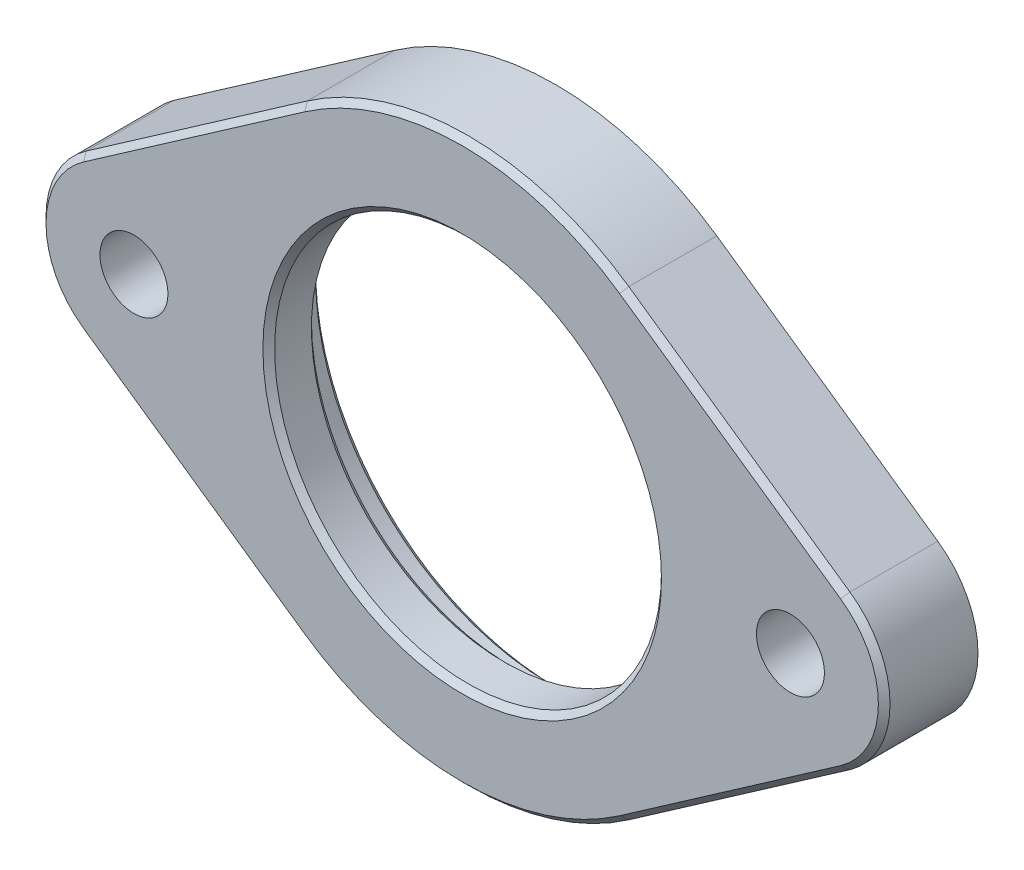
ISO-10303-21;
HEADER;
FILE_DESCRIPTION(('STEP AP214'),'2;1');
FILE_NAME('part.step','',(''),(''),'','','');
FILE_SCHEMA(('AUTOMOTIVE_DESIGN { 1 0 10303 214 1 1 1 1 }'));
ENDSEC;
DATA;
#1=APPLICATION_CONTEXT('core data for automotive mechanical design processes');
#2=APPLICATION_PROTOCOL_DEFINITION('international standard','automotive_design',2000,#1);
#3=PRODUCT_CONTEXT('',#1,'mechanical');
#4=PRODUCT('Part','Part','',(#3));
#5=PRODUCT_RELATED_PRODUCT_CATEGORY('part','',(#4));
#6=PRODUCT_DEFINITION_FORMATION('','',#4);
#7=PRODUCT_DEFINITION_CONTEXT('part definition',#1,'design');
#8=PRODUCT_DEFINITION('design','',#6,#7);
#9=PRODUCT_DEFINITION_SHAPE('','',#8);
#10=(LENGTH_UNIT() NAMED_UNIT(*) SI_UNIT(.MILLI.,.METRE.));
#11=(NAMED_UNIT(*) PLANE_ANGLE_UNIT() SI_UNIT($,.RADIAN.));
#12=(NAMED_UNIT(*) SI_UNIT($,.STERADIAN.) SOLID_ANGLE_UNIT());
#13=UNCERTAINTY_MEASURE_WITH_UNIT(LENGTH_MEASURE(1.E-05),#10,'distance_accuracy_value','');
#14=(GEOMETRIC_REPRESENTATION_CONTEXT(3) GLOBAL_UNCERTAINTY_ASSIGNED_CONTEXT((#13)) GLOBAL_UNIT_ASSIGNED_CONTEXT((#10,
#11,#12)) REPRESENTATION_CONTEXT('',''));
#15=CARTESIAN_POINT('',(0.,0.,0.));
#16=DIRECTION('',(0.,0.,1.));
#17=DIRECTION('',(1.,0.,0.));
#18=AXIS2_PLACEMENT_3D('',#15,#16,#17);
#19=CARTESIAN_POINT('',(-14.,0.,4.));
#20=DIRECTION('',(0.,0.,-1.));
#21=DIRECTION('',(-1.,0.,0.));
#22=AXIS2_PLACEMENT_3D('',#19,#20,#21);
#23=CYLINDRICAL_SURFACE('',#22,4.);
#24=DIRECTION('',(0.,0.,-1.));
#25=VECTOR('',#24,1.);
#26=CARTESIAN_POINT('',(-16.2857142857143,-3.28260722659316,4.));
#27=LINE('',#26,#25);
#28=CARTESIAN_POINT('',(-16.2857142857143,-3.28260722659316,3.74999999999999));
#29=VERTEX_POINT('',#28);
#30=CARTESIAN_POINT('',(-16.2857142857143,-3.28260722659316,0.));
#31=VERTEX_POINT('',#30);
#32=EDGE_CURVE('E171',#29,#31,#27,.T.);
#33=ORIENTED_EDGE('',*,*,#32,.F.);
#34=CARTESIAN_POINT('',(-14.,0.,3.74999999999999));
#35=DIRECTION('',(0.,0.,1.));
#36=DIRECTION('',(1.,0.,0.));
#37=AXIS2_PLACEMENT_3D('',#34,#35,#36);
#38=CIRCLE('',#37,4.);
#39=CARTESIAN_POINT('',(-16.2857142857143,3.28260722659316,3.74999999999999));
#40=VERTEX_POINT('',#39);
#41=EDGE_CURVE('E168',#29,#40,#38,.F.);
#42=ORIENTED_EDGE('',*,*,#41,.T.);
#43=DIRECTION('',(0.,0.,-1.));
#44=VECTOR('',#43,1.);
#45=CARTESIAN_POINT('',(-16.2857142857143,3.28260722659316,4.));
#46=LINE('',#45,#44);
#47=CARTESIAN_POINT('',(-16.2857142857143,3.28260722659316,0.));
#48=VERTEX_POINT('',#47);
#49=EDGE_CURVE('E162',#40,#48,#46,.T.);
#50=ORIENTED_EDGE('',*,*,#49,.T.);
#51=CARTESIAN_POINT('',(-14.,0.,0.));
#52=DIRECTION('',(0.,0.,1.));
#53=DIRECTION('',(1.,0.,0.));
#54=AXIS2_PLACEMENT_3D('',#51,#52,#53);
#55=CIRCLE('',#54,4.);
#56=EDGE_CURVE('E165',#48,#31,#55,.T.);
#57=ORIENTED_EDGE('',*,*,#56,.T.);
#58=EDGE_LOOP('',(#33,#42,#50,#57));
#59=FACE_BOUND('',#58,.T.);
#60=ADVANCED_FACE('F73',(#59),#23,.T.);
#61=CARTESIAN_POINT('',(-6.85714285714286,-9.84782167977948,4.));
#62=DIRECTION('',(-0.571428571428572,-0.82065180664829,0.));
#63=DIRECTION('',(0.82065180664829,-0.571428571428572,0.));
#64=AXIS2_PLACEMENT_3D('',#61,#62,#63);
#65=PLANE('',#64);
#66=DIRECTION('',(0.,0.,-1.));
#67=VECTOR('',#66,1.);
#68=CARTESIAN_POINT('',(-6.85714285714286,-9.84782167977948,4.));
#69=LINE('',#68,#67);
#70=CARTESIAN_POINT('',(-6.85714285714286,-9.84782167977948,3.74999999999999));
#71=VERTEX_POINT('',#70);
#72=CARTESIAN_POINT('',(-6.85714285714286,-9.84782167977948,0.));
#73=VERTEX_POINT('',#72);
#74=EDGE_CURVE('E195',#71,#73,#69,.T.);
#75=ORIENTED_EDGE('',*,*,#74,.F.);
#76=DIRECTION('',(-0.82065180664829,0.571428571428572,0.));
#77=VECTOR('',#76,1.);
#78=CARTESIAN_POINT('',(-6.85714285714286,-9.84782167977948,3.74999999999999));
#79=LINE('',#78,#77);
#80=EDGE_CURVE('E260',#71,#29,#79,.T.);
#81=ORIENTED_EDGE('',*,*,#80,.T.);
#82=ORIENTED_EDGE('',*,*,#32,.T.);
#83=DIRECTION('',(-0.82065180664829,0.571428571428572,0.));
#84=VECTOR('',#83,1.);
#85=CARTESIAN_POINT('',(-6.85714285714286,-9.84782167977948,0.));
#86=LINE('',#85,#84);
#87=EDGE_CURVE('E180',#73,#31,#86,.T.);
#88=ORIENTED_EDGE('',*,*,#87,.F.);
#89=EDGE_LOOP('',(#75,#81,#82,#88));
#90=FACE_BOUND('',#89,.T.);
#91=ADVANCED_FACE('F331',(#90),#65,.T.);
#92=CARTESIAN_POINT('',(-6.85714285714286,9.84782167977948,4.));
#93=DIRECTION('',(0.571428571428572,-0.82065180664829,0.));
#94=DIRECTION('',(0.82065180664829,0.571428571428572,0.));
#95=AXIS2_PLACEMENT_3D('',#92,#93,#94);
#96=PLANE('',#95);
#97=ORIENTED_EDGE('',*,*,#49,.F.);
#98=DIRECTION('',(0.82065180664829,0.571428571428572,0.));
#99=VECTOR('',#98,1.);
#100=CARTESIAN_POINT('',(-6.85714285714286,9.84782167977948,3.74999999999999));
#101=LINE('',#100,#99);
#102=CARTESIAN_POINT('',(-6.85714285714286,9.84782167977948,3.74999999999999));
#103=VERTEX_POINT('',#102);
#104=EDGE_CURVE('E83',#40,#103,#101,.T.);
#105=ORIENTED_EDGE('',*,*,#104,.T.);
#106=DIRECTION('',(0.,0.,-1.));
#107=VECTOR('',#106,1.);
#108=CARTESIAN_POINT('',(-6.85714285714286,9.84782167977948,4.));
#109=LINE('',#108,#107);
#110=CARTESIAN_POINT('',(-6.85714285714286,9.84782167977948,0.));
#111=VERTEX_POINT('',#110);
#112=EDGE_CURVE('E183',#103,#111,#109,.T.);
#113=ORIENTED_EDGE('',*,*,#112,.T.);
#114=DIRECTION('',(-0.82065180664829,-0.571428571428572,0.));
#115=VECTOR('',#114,1.);
#116=CARTESIAN_POINT('',(-6.85714285714286,9.84782167977948,0.));
#117=LINE('',#116,#115);
#118=EDGE_CURVE('E177',#111,#48,#117,.T.);
#119=ORIENTED_EDGE('',*,*,#118,.T.);
#120=EDGE_LOOP('',(#97,#105,#113,#119));
#121=FACE_BOUND('',#120,.T.);
#122=ADVANCED_FACE('F182',(#121),#96,.F.);
#123=CARTESIAN_POINT('',(0.,0.,0.));
#124=DIRECTION('',(0.,0.,1.));
#125=DIRECTION('',(1.,0.,0.));
#126=AXIS2_PLACEMENT_3D('',#123,#124,#125);
#127=PLANE('',#126);
#128=CARTESIAN_POINT('',(0.,0.,0.));
#129=DIRECTION('',(0.,0.,1.));
#130=DIRECTION('',(1.,0.,0.));
#131=AXIS2_PLACEMENT_3D('',#128,#129,#130);
#132=CIRCLE('',#131,10.25);
#133=CARTESIAN_POINT('',(10.25,0.,0.));
#134=VERTEX_POINT('',#133);
#135=EDGE_CURVE('E246',#134,#134,#132,.T.);
#136=ORIENTED_EDGE('',*,*,#135,.T.);
#137=EDGE_LOOP('',(#136));
#138=FACE_BOUND('',#137,.T.);
#139=CARTESIAN_POINT('',(-14.,0.,0.));
#140=DIRECTION('',(0.,0.,1.));
#141=DIRECTION('',(1.,0.,0.));
#142=AXIS2_PLACEMENT_3D('',#139,#140,#141);
#143=CIRCLE('',#142,1.45);
#144=CARTESIAN_POINT('',(-12.55,0.,0.));
#145=VERTEX_POINT('',#144);
#146=EDGE_CURVE('E295',#145,#145,#143,.T.);
#147=ORIENTED_EDGE('',*,*,#146,.T.);
#148=EDGE_LOOP('',(#147));
#149=FACE_BOUND('',#148,.T.);
#150=CARTESIAN_POINT('',(14.,0.,0.));
#151=DIRECTION('',(0.,0.,1.));
#152=DIRECTION('',(1.,0.,0.));
#153=AXIS2_PLACEMENT_3D('',#150,#151,#152);
#154=CIRCLE('',#153,1.45);
#155=CARTESIAN_POINT('',(15.45,0.,0.));
#156=VERTEX_POINT('',#155);
#157=EDGE_CURVE('E190',#156,#156,#154,.T.);
#158=ORIENTED_EDGE('',*,*,#157,.T.);
#159=EDGE_LOOP('',(#158));
#160=FACE_BOUND('',#159,.T.);
#161=ORIENTED_EDGE('',*,*,#118,.F.);
#162=CARTESIAN_POINT('',(0.,0.,0.));
#163=DIRECTION('',(0.,0.,1.));
#164=DIRECTION('',(1.,0.,0.));
#165=AXIS2_PLACEMENT_3D('',#162,#163,#164);
#166=CIRCLE('',#165,12.);
#167=CARTESIAN_POINT('',(6.85714285714286,9.84782167977948,0.));
#168=VERTEX_POINT('',#167);
#169=EDGE_CURVE('E202',#168,#111,#166,.T.);
#170=ORIENTED_EDGE('',*,*,#169,.F.);
#171=DIRECTION('',(0.82065180664829,-0.571428571428571,0.));
#172=VECTOR('',#171,1.);
#173=CARTESIAN_POINT('',(6.85714285714286,9.84782167977948,0.));
#174=LINE('',#173,#172);
#175=CARTESIAN_POINT('',(16.2857142857143,3.28260722659316,0.));
#176=VERTEX_POINT('',#175);
#177=EDGE_CURVE('E205',#168,#176,#174,.T.);
#178=ORIENTED_EDGE('',*,*,#177,.T.);
#179=CARTESIAN_POINT('',(14.,0.,0.));
#180=DIRECTION('',(0.,0.,1.));
#181=DIRECTION('',(1.,0.,0.));
#182=AXIS2_PLACEMENT_3D('',#179,#180,#181);
#183=CIRCLE('',#182,4.);
#184=CARTESIAN_POINT('',(16.2857142857143,-3.28260722659315,0.));
#185=VERTEX_POINT('',#184);
#186=EDGE_CURVE('E201',#185,#176,#183,.T.);
#187=ORIENTED_EDGE('',*,*,#186,.F.);
#188=DIRECTION('',(0.820651806648289,0.571428571428572,0.));
#189=VECTOR('',#188,1.);
#190=CARTESIAN_POINT('',(6.85714285714287,-9.84782167977947,0.));
#191=LINE('',#190,#189);
#192=CARTESIAN_POINT('',(6.85714285714286,-9.84782167977948,0.));
#193=VERTEX_POINT('',#192);
#194=EDGE_CURVE('E198',#193,#185,#191,.T.);
#195=ORIENTED_EDGE('',*,*,#194,.F.);
#196=EDGE_CURVE('E214',#73,#193,#166,.T.);
#197=ORIENTED_EDGE('',*,*,#196,.F.);
#198=ORIENTED_EDGE('',*,*,#87,.T.);
#199=ORIENTED_EDGE('',*,*,#56,.F.);
#200=EDGE_LOOP('',(#161,#170,#178,#187,#195,#197,#198,#199));
#201=FACE_BOUND('',#200,.T.);
#202=ADVANCED_FACE('F175',(#138,#149,#160,#201),#127,.F.);
#203=CARTESIAN_POINT('',(0.,0.,4.));
#204=DIRECTION('',(0.,0.,1.));
#205=DIRECTION('',(1.,0.,0.));
#206=AXIS2_PLACEMENT_3D('',#203,#204,#205);
#207=PLANE('',#206);
#208=CARTESIAN_POINT('',(0.,0.,4.));
#209=DIRECTION('',(0.,0.,1.));
#210=DIRECTION('',(1.,0.,0.));
#211=AXIS2_PLACEMENT_3D('',#208,#209,#210);
#212=CIRCLE('',#211,8.50000000000002);
#213=CARTESIAN_POINT('',(8.50000000000002,0.,4.));
#214=VERTEX_POINT('',#213);
#215=EDGE_CURVE('E237',#214,#214,#212,.F.);
#216=ORIENTED_EDGE('',*,*,#215,.T.);
#217=EDGE_LOOP('',(#216));
#218=FACE_BOUND('',#217,.T.);
#219=DIRECTION('',(0.82065180664829,-0.571428571428572,0.));
#220=VECTOR('',#219,1.);
#221=CARTESIAN_POINT('',(-6.71428571428572,-9.64265872811741,4.));
#222=LINE('',#221,#220);
#223=CARTESIAN_POINT('',(-16.1428571428571,-3.07744427493108,4.));
#224=VERTEX_POINT('',#223);
#225=CARTESIAN_POINT('',(-6.71428571428571,-9.64265872811741,4.));
#226=VERTEX_POINT('',#225);
#227=EDGE_CURVE('E230',#224,#226,#222,.T.);
#228=ORIENTED_EDGE('',*,*,#227,.T.);
#229=CARTESIAN_POINT('',(0.,0.,4.));
#230=DIRECTION('',(0.,0.,1.));
#231=DIRECTION('',(1.,0.,0.));
#232=AXIS2_PLACEMENT_3D('',#229,#230,#231);
#233=CIRCLE('',#232,11.75);
#234=CARTESIAN_POINT('',(6.71428571428571,-9.6426587281174,4.));
#235=VERTEX_POINT('',#234);
#236=EDGE_CURVE('E234',#226,#235,#233,.T.);
#237=ORIENTED_EDGE('',*,*,#236,.T.);
#238=DIRECTION('',(0.820651806648289,0.571428571428572,0.));
#239=VECTOR('',#238,1.);
#240=CARTESIAN_POINT('',(16.1428571428571,-3.07744427493107,4.));
#241=LINE('',#240,#239);
#242=CARTESIAN_POINT('',(16.1428571428571,-3.07744427493107,4.));
#243=VERTEX_POINT('',#242);
#244=EDGE_CURVE('E232',#235,#243,#241,.T.);
#245=ORIENTED_EDGE('',*,*,#244,.T.);
#246=CARTESIAN_POINT('',(14.,0.,4.));
#247=DIRECTION('',(0.,0.,1.));
#248=DIRECTION('',(1.,0.,0.));
#249=AXIS2_PLACEMENT_3D('',#246,#247,#248);
#250=CIRCLE('',#249,3.74999999999999);
#251=CARTESIAN_POINT('',(16.1428571428571,3.07744427493108,4.));
#252=VERTEX_POINT('',#251);
#253=EDGE_CURVE('E228',#243,#252,#250,.T.);
#254=ORIENTED_EDGE('',*,*,#253,.T.);
#255=DIRECTION('',(-0.82065180664829,0.571428571428571,0.));
#256=VECTOR('',#255,1.);
#257=CARTESIAN_POINT('',(6.71428571428571,9.6426587281174,4.));
#258=LINE('',#257,#256);
#259=CARTESIAN_POINT('',(6.71428571428571,9.6426587281174,4.));
#260=VERTEX_POINT('',#259);
#261=EDGE_CURVE('E224',#252,#260,#258,.T.);
#262=ORIENTED_EDGE('',*,*,#261,.T.);
#263=CARTESIAN_POINT('',(0.,0.,4.));
#264=DIRECTION('',(0.,0.,1.));
#265=DIRECTION('',(1.,0.,0.));
#266=AXIS2_PLACEMENT_3D('',#263,#264,#265);
#267=CIRCLE('',#266,11.75);
#268=CARTESIAN_POINT('',(-6.71428571428571,9.6426587281174,4.));
#269=VERTEX_POINT('',#268);
#270=EDGE_CURVE('E220',#260,#269,#267,.T.);
#271=ORIENTED_EDGE('',*,*,#270,.T.);
#272=DIRECTION('',(-0.82065180664829,-0.571428571428572,0.));
#273=VECTOR('',#272,1.);
#274=CARTESIAN_POINT('',(-16.1428571428571,3.07744427493108,4.));
#275=LINE('',#274,#273);
#276=CARTESIAN_POINT('',(-16.1428571428571,3.07744427493108,4.));
#277=VERTEX_POINT('',#276);
#278=EDGE_CURVE('E222',#269,#277,#275,.T.);
#279=ORIENTED_EDGE('',*,*,#278,.T.);
#280=CARTESIAN_POINT('',(-14.,0.,4.));
#281=DIRECTION('',(0.,0.,1.));
#282=DIRECTION('',(1.,0.,0.));
#283=AXIS2_PLACEMENT_3D('',#280,#281,#282);
#284=CIRCLE('',#283,3.74999999999999);
#285=EDGE_CURVE('E226',#277,#224,#284,.T.);
#286=ORIENTED_EDGE('',*,*,#285,.T.);
#287=EDGE_LOOP('',(#228,#237,#245,#254,#262,#271,#279,#286));
#288=FACE_BOUND('',#287,.T.);
#289=CARTESIAN_POINT('',(-14.,0.,4.));
#290=DIRECTION('',(0.,0.,1.));
#291=DIRECTION('',(1.,0.,0.));
#292=AXIS2_PLACEMENT_3D('',#289,#290,#291);
#293=CIRCLE('',#292,1.45);
#294=CARTESIAN_POINT('',(-12.55,0.,4.));
#295=VERTEX_POINT('',#294);
#296=EDGE_CURVE('E290',#295,#295,#293,.T.);
#297=ORIENTED_EDGE('',*,*,#296,.F.);
#298=EDGE_LOOP('',(#297));
#299=FACE_BOUND('',#298,.T.);
#300=CARTESIAN_POINT('',(14.,0.,4.));
#301=DIRECTION('',(0.,0.,1.));
#302=DIRECTION('',(1.,0.,0.));
#303=AXIS2_PLACEMENT_3D('',#300,#301,#302);
#304=CIRCLE('',#303,1.45);
#305=CARTESIAN_POINT('',(15.45,0.,4.));
#306=VERTEX_POINT('',#305);
#307=EDGE_CURVE('E300',#306,#306,#304,.T.);
#308=ORIENTED_EDGE('',*,*,#307,.F.);
#309=EDGE_LOOP('',(#308));
#310=FACE_BOUND('',#309,.T.);
#311=ADVANCED_FACE('F341',(#218,#288,#299,#310),#207,.T.);
#312=CARTESIAN_POINT('',(14.,0.,4.));
#313=DIRECTION('',(0.,0.,-1.));
#314=DIRECTION('',(-1.,0.,0.));
#315=AXIS2_PLACEMENT_3D('',#312,#313,#314);
#316=CYLINDRICAL_SURFACE('',#315,4.);
#317=DIRECTION('',(0.,0.,-1.));
#318=VECTOR('',#317,1.);
#319=CARTESIAN_POINT('',(16.2857142857143,3.28260722659316,4.));
#320=LINE('',#319,#318);
#321=CARTESIAN_POINT('',(16.2857142857143,3.28260722659316,3.74999999999999));
#322=VERTEX_POINT('',#321);
#323=EDGE_CURVE('E210',#322,#176,#320,.T.);
#324=ORIENTED_EDGE('',*,*,#323,.F.);
#325=CARTESIAN_POINT('',(14.,0.,3.74999999999999));
#326=DIRECTION('',(0.,0.,1.));
#327=DIRECTION('',(1.,0.,0.));
#328=AXIS2_PLACEMENT_3D('',#325,#326,#327);
#329=CIRCLE('',#328,4.);
#330=CARTESIAN_POINT('',(16.2857142857143,-3.28260722659315,3.74999999999999));
#331=VERTEX_POINT('',#330);
#332=EDGE_CURVE('E262',#322,#331,#329,.F.);
#333=ORIENTED_EDGE('',*,*,#332,.T.);
#334=DIRECTION('',(0.,0.,-1.));
#335=VECTOR('',#334,1.);
#336=CARTESIAN_POINT('',(16.2857142857143,-3.28260722659315,4.));
#337=LINE('',#336,#335);
#338=EDGE_CURVE('E187',#331,#185,#337,.T.);
#339=ORIENTED_EDGE('',*,*,#338,.T.);
#340=ORIENTED_EDGE('',*,*,#186,.T.);
#341=EDGE_LOOP('',(#324,#333,#339,#340));
#342=FACE_BOUND('',#341,.T.);
#343=ADVANCED_FACE('F369',(#342),#316,.T.);
#344=CARTESIAN_POINT('',(6.85714285714286,9.84782167977948,4.));
#345=DIRECTION('',(0.571428571428571,0.82065180664829,0.));
#346=DIRECTION('',(-0.82065180664829,0.571428571428571,0.));
#347=AXIS2_PLACEMENT_3D('',#344,#345,#346);
#348=PLANE('',#347);
#349=DIRECTION('',(0.,0.,-1.));
#350=VECTOR('',#349,1.);
#351=CARTESIAN_POINT('',(6.85714285714286,9.84782167977948,4.));
#352=LINE('',#351,#350);
#353=CARTESIAN_POINT('',(6.85714285714286,9.84782167977948,3.74999999999999));
#354=VERTEX_POINT('',#353);
#355=EDGE_CURVE('E208',#354,#168,#352,.T.);
#356=ORIENTED_EDGE('',*,*,#355,.F.);
#357=DIRECTION('',(0.82065180664829,-0.571428571428571,0.));
#358=VECTOR('',#357,1.);
#359=CARTESIAN_POINT('',(6.85714285714286,9.84782167977948,3.74999999999999));
#360=LINE('',#359,#358);
#361=EDGE_CURVE('E265',#354,#322,#360,.T.);
#362=ORIENTED_EDGE('',*,*,#361,.T.);
#363=ORIENTED_EDGE('',*,*,#323,.T.);
#364=ORIENTED_EDGE('',*,*,#177,.F.);
#365=EDGE_LOOP('',(#356,#362,#363,#364));
#366=FACE_BOUND('',#365,.T.);
#367=ADVANCED_FACE('F366',(#366),#348,.T.);
#368=CARTESIAN_POINT('',(6.85714285714287,-9.84782167977947,4.));
#369=DIRECTION('',(-0.571428571428572,0.820651806648289,0.));
#370=DIRECTION('',(-0.820651806648289,-0.571428571428572,0.));
#371=AXIS2_PLACEMENT_3D('',#368,#369,#370);
#372=PLANE('',#371);
#373=ORIENTED_EDGE('',*,*,#338,.F.);
#374=DIRECTION('',(-0.820651806648289,-0.571428571428572,0.));
#375=VECTOR('',#374,1.);
#376=CARTESIAN_POINT('',(6.85714285714286,-9.84782167977948,3.74999999999999));
#377=LINE('',#376,#375);
#378=CARTESIAN_POINT('',(6.85714285714286,-9.84782167977948,3.74999999999999));
#379=VERTEX_POINT('',#378);
#380=EDGE_CURVE('E258',#331,#379,#377,.T.);
#381=ORIENTED_EDGE('',*,*,#380,.T.);
#382=DIRECTION('',(0.,0.,-1.));
#383=VECTOR('',#382,1.);
#384=CARTESIAN_POINT('',(6.85714285714286,-9.84782167977948,4.));
#385=LINE('',#384,#383);
#386=EDGE_CURVE('E185',#379,#193,#385,.T.);
#387=ORIENTED_EDGE('',*,*,#386,.T.);
#388=ORIENTED_EDGE('',*,*,#194,.T.);
#389=EDGE_LOOP('',(#373,#381,#387,#388));
#390=FACE_BOUND('',#389,.T.);
#391=ADVANCED_FACE('F318',(#390),#372,.F.);
#392=CARTESIAN_POINT('',(0.,0.,4.));
#393=DIRECTION('',(0.,0.,-1.));
#394=DIRECTION('',(-1.,0.,0.));
#395=AXIS2_PLACEMENT_3D('',#392,#393,#394);
#396=CYLINDRICAL_SURFACE('',#395,12.);
#397=ORIENTED_EDGE('',*,*,#386,.F.);
#398=CARTESIAN_POINT('',(0.,0.,3.74999999999999));
#399=DIRECTION('',(0.,0.,1.));
#400=DIRECTION('',(1.,0.,0.));
#401=AXIS2_PLACEMENT_3D('',#398,#399,#400);
#402=CIRCLE('',#401,12.);
#403=EDGE_CURVE('E255',#379,#71,#402,.F.);
#404=ORIENTED_EDGE('',*,*,#403,.T.);
#405=ORIENTED_EDGE('',*,*,#74,.T.);
#406=ORIENTED_EDGE('',*,*,#196,.T.);
#407=EDGE_LOOP('',(#397,#404,#405,#406));
#408=FACE_BOUND('',#407,.T.);
#409=ADVANCED_FACE('F312',(#408),#396,.T.);
#410=ORIENTED_EDGE('',*,*,#112,.F.);
#411=CARTESIAN_POINT('',(0.,0.,3.74999999999999));
#412=DIRECTION('',(0.,0.,1.));
#413=DIRECTION('',(1.,0.,0.));
#414=AXIS2_PLACEMENT_3D('',#411,#412,#413);
#415=CIRCLE('',#414,12.);
#416=EDGE_CURVE('E12',#103,#354,#415,.F.);
#417=ORIENTED_EDGE('',*,*,#416,.T.);
#418=ORIENTED_EDGE('',*,*,#355,.T.);
#419=ORIENTED_EDGE('',*,*,#169,.T.);
#420=EDGE_LOOP('',(#410,#417,#418,#419));
#421=FACE_BOUND('',#420,.T.);
#422=ADVANCED_FACE('F371',(#421),#396,.T.);
#423=CARTESIAN_POINT('',(0.,0.,-1.2E-05));
#424=DIRECTION('',(0.,0.,1.));
#425=DIRECTION('',(1.,0.,0.));
#426=AXIS2_PLACEMENT_3D('',#423,#424,#425);
#427=CYLINDRICAL_SURFACE('',#426,8.25);
#428=CARTESIAN_POINT('',(0.,0.,3.74999999999999));
#429=DIRECTION('',(0.,0.,1.));
#430=DIRECTION('',(1.,0.,0.));
#431=AXIS2_PLACEMENT_3D('',#428,#429,#430);
#432=CIRCLE('',#431,8.25);
#433=CARTESIAN_POINT('',(8.25,0.,3.74999999999999));
#434=VERTEX_POINT('',#433);
#435=EDGE_CURVE('E217',#434,#434,#432,.T.);
#436=ORIENTED_EDGE('',*,*,#435,.T.);
#437=EDGE_LOOP('',(#436));
#438=FACE_BOUND('',#437,.T.);
#439=CARTESIAN_POINT('',(0.,0.,2.18000000000002));
#440=DIRECTION('',(0.,0.,1.));
#441=DIRECTION('',(1.,0.,0.));
#442=AXIS2_PLACEMENT_3D('',#439,#440,#441);
#443=CIRCLE('',#442,8.25);
#444=CARTESIAN_POINT('',(8.25,0.,2.18000000000002));
#445=VERTEX_POINT('',#444);
#446=EDGE_CURVE('E170',#445,#445,#443,.F.);
#447=ORIENTED_EDGE('',*,*,#446,.T.);
#448=EDGE_LOOP('',(#447));
#449=FACE_BOUND('',#448,.T.);
#450=ADVANCED_FACE('F379',(#438,#449),#427,.F.);
#451=CARTESIAN_POINT('',(0.,0.,-1.2E-05));
#452=DIRECTION('',(0.,0.,1.));
#453=DIRECTION('',(1.,0.,0.));
#454=AXIS2_PLACEMENT_3D('',#451,#452,#453);
#455=CYLINDRICAL_SURFACE('',#454,10.);
#456=CARTESIAN_POINT('',(0.,0.,0.249999999999983));
#457=DIRECTION('',(0.,0.,1.));
#458=DIRECTION('',(1.,0.,0.));
#459=AXIS2_PLACEMENT_3D('',#456,#457,#458);
#460=CIRCLE('',#459,10.);
#461=CARTESIAN_POINT('',(10.,0.,0.249999999999983));
#462=VERTEX_POINT('',#461);
#463=EDGE_CURVE('E252',#462,#462,#460,.F.);
#464=ORIENTED_EDGE('',*,*,#463,.T.);
#465=EDGE_LOOP('',(#464));
#466=FACE_BOUND('',#465,.T.);
#467=CARTESIAN_POINT('',(0.,0.,1.67999999999999));
#468=DIRECTION('',(0.,0.,1.));
#469=DIRECTION('',(1.,0.,0.));
#470=AXIS2_PLACEMENT_3D('',#467,#468,#469);
#471=CIRCLE('',#470,10.);
#472=CARTESIAN_POINT('',(10.,0.,1.67999999999999));
#473=VERTEX_POINT('',#472);
#474=EDGE_CURVE('E249',#473,#473,#471,.T.);
#475=ORIENTED_EDGE('',*,*,#474,.T.);
#476=EDGE_LOOP('',(#475));
#477=FACE_BOUND('',#476,.T.);
#478=ADVANCED_FACE('F528',(#466,#477),#455,.F.);
#479=CARTESIAN_POINT('',(0.,0.,1.93));
#480=DIRECTION('',(0.,0.,1.));
#481=DIRECTION('',(1.,0.,0.));
#482=AXIS2_PLACEMENT_3D('',#479,#480,#481);
#483=PLANE('',#482);
#484=CARTESIAN_POINT('',(0.,0.,1.93));
#485=DIRECTION('',(0.,0.,1.));
#486=DIRECTION('',(1.,0.,0.));
#487=AXIS2_PLACEMENT_3D('',#484,#485,#486);
#488=CIRCLE('',#487,8.50000000000002);
#489=CARTESIAN_POINT('',(8.50000000000002,0.,1.93));
#490=VERTEX_POINT('',#489);
#491=EDGE_CURVE('E243',#490,#490,#488,.T.);
#492=ORIENTED_EDGE('',*,*,#491,.T.);
#493=EDGE_LOOP('',(#492));
#494=FACE_BOUND('',#493,.T.);
#495=CARTESIAN_POINT('',(0.,0.,1.93));
#496=DIRECTION('',(0.,0.,1.));
#497=DIRECTION('',(1.,0.,0.));
#498=AXIS2_PLACEMENT_3D('',#495,#496,#497);
#499=CIRCLE('',#498,9.74999999999999);
#500=CARTESIAN_POINT('',(9.74999999999999,0.,1.93));
#501=VERTEX_POINT('',#500);
#502=EDGE_CURVE('E240',#501,#501,#499,.F.);
#503=ORIENTED_EDGE('',*,*,#502,.T.);
#504=EDGE_LOOP('',(#503));
#505=FACE_BOUND('',#504,.T.);
#506=ADVANCED_FACE('F519',(#494,#505),#483,.F.);
#507=CARTESIAN_POINT('',(14.,0.,4.));
#508=DIRECTION('',(0.,0.,1.));
#509=DIRECTION('',(1.,0.,0.));
#510=AXIS2_PLACEMENT_3D('',#507,#508,#509);
#511=CYLINDRICAL_SURFACE('',#510,1.45);
#512=ORIENTED_EDGE('',*,*,#157,.F.);
#513=EDGE_LOOP('',(#512));
#514=FACE_BOUND('',#513,.T.);
#515=ORIENTED_EDGE('',*,*,#307,.T.);
#516=EDGE_LOOP('',(#515));
#517=FACE_BOUND('',#516,.T.);
#518=ADVANCED_FACE('F510',(#514,#517),#511,.F.);
#519=CARTESIAN_POINT('',(-14.,0.,4.));
#520=DIRECTION('',(0.,0.,1.));
#521=DIRECTION('',(1.,0.,0.));
#522=AXIS2_PLACEMENT_3D('',#519,#520,#521);
#523=CYLINDRICAL_SURFACE('',#522,1.45);
#524=ORIENTED_EDGE('',*,*,#146,.F.);
#525=EDGE_LOOP('',(#524));
#526=FACE_BOUND('',#525,.T.);
#527=ORIENTED_EDGE('',*,*,#296,.T.);
#528=EDGE_LOOP('',(#527));
#529=FACE_BOUND('',#528,.T.);
#530=ADVANCED_FACE('F388',(#526,#529),#523,.F.);
#531=CARTESIAN_POINT('',(0.,0.,3.74999999999999));
#532=DIRECTION('',(0.,0.,1.));
#533=DIRECTION('',(1.,0.,0.));
#534=AXIS2_PLACEMENT_3D('',#531,#532,#533);
#535=CONICAL_SURFACE('',#534,8.25,0.785398163397459);
#536=ORIENTED_EDGE('',*,*,#215,.F.);
#537=EDGE_LOOP('',(#536));
#538=FACE_BOUND('',#537,.T.);
#539=ORIENTED_EDGE('',*,*,#435,.F.);
#540=EDGE_LOOP('',(#539));
#541=FACE_BOUND('',#540,.T.);
#542=ADVANCED_FACE('F381',(#538,#541),#535,.F.);
#543=CARTESIAN_POINT('',(0.,0.,2.18000000000002));
#544=DIRECTION('',(0.,0.,-1.));
#545=DIRECTION('',(-1.,0.,0.));
#546=AXIS2_PLACEMENT_3D('',#543,#544,#545);
#547=CONICAL_SURFACE('',#546,8.25,0.785398163397445);
#548=ORIENTED_EDGE('',*,*,#491,.F.);
#549=EDGE_LOOP('',(#548));
#550=FACE_BOUND('',#549,.T.);
#551=ORIENTED_EDGE('',*,*,#446,.F.);
#552=EDGE_LOOP('',(#551));
#553=FACE_BOUND('',#552,.T.);
#554=ADVANCED_FACE('F387',(#550,#553),#547,.F.);
#555=CARTESIAN_POINT('',(0.,0.,0.));
#556=DIRECTION('',(0.,0.,-1.));
#557=DIRECTION('',(-1.,0.,0.));
#558=AXIS2_PLACEMENT_3D('',#555,#556,#557);
#559=CONICAL_SURFACE('',#558,10.25,0.785398163397441);
#560=ORIENTED_EDGE('',*,*,#463,.F.);
#561=EDGE_LOOP('',(#560));
#562=FACE_BOUND('',#561,.T.);
#563=ORIENTED_EDGE('',*,*,#135,.F.);
#564=EDGE_LOOP('',(#563));
#565=FACE_BOUND('',#564,.T.);
#566=ADVANCED_FACE('F395',(#562,#565),#559,.F.);
#567=CARTESIAN_POINT('',(0.,0.,1.67999999999999));
#568=DIRECTION('',(0.,0.,-1.));
#569=DIRECTION('',(-1.,0.,0.));
#570=AXIS2_PLACEMENT_3D('',#567,#568,#569);
#571=CONICAL_SURFACE('',#570,10.,0.785398163397448);
#572=ORIENTED_EDGE('',*,*,#502,.F.);
#573=EDGE_LOOP('',(#572));
#574=FACE_BOUND('',#573,.T.);
#575=ORIENTED_EDGE('',*,*,#474,.F.);
#576=EDGE_LOOP('',(#575));
#577=FACE_BOUND('',#576,.T.);
#578=ADVANCED_FACE('F352',(#574,#577),#571,.F.);
#579=CARTESIAN_POINT('',(0.,0.,4.));
#580=DIRECTION('',(0.,0.,-1.));
#581=DIRECTION('',(-1.,0.,0.));
#582=AXIS2_PLACEMENT_3D('',#579,#580,#581);
#583=CONICAL_SURFACE('',#582,11.75,0.785398163397445);
#584=DIRECTION('',(-0.404061017820885,-0.580288457473999,0.707106781186546));
#585=VECTOR('',#584,1.);
#586=CARTESIAN_POINT('',(6.85714285714286,9.84782167977948,3.74999999999999));
#587=LINE('',#586,#585);
#588=EDGE_CURVE('E283',#354,#260,#587,.T.);
#589=ORIENTED_EDGE('',*,*,#588,.F.);
#590=ORIENTED_EDGE('',*,*,#416,.F.);
#591=DIRECTION('',(-0.404061017820883,0.580288457473994,-0.707106781186551));
#592=VECTOR('',#591,1.);
#593=CARTESIAN_POINT('',(-6.71428571428571,9.6426587281174,4.));
#594=LINE('',#593,#592);
#595=EDGE_CURVE('E78',#269,#103,#594,.T.);
#596=ORIENTED_EDGE('',*,*,#595,.F.);
#597=ORIENTED_EDGE('',*,*,#270,.F.);
#598=EDGE_LOOP('',(#589,#590,#596,#597));
#599=FACE_BOUND('',#598,.T.);
#600=ADVANCED_FACE('F76',(#599),#583,.T.);
#601=CARTESIAN_POINT('',(-6.71428571428571,9.6426587281174,4.));
#602=DIRECTION('',(-0.404061017820886,0.580288457473999,0.707106781186545));
#603=DIRECTION('',(0.82065180664829,0.571428571428572,0.));
#604=AXIS2_PLACEMENT_3D('',#601,#602,#603);
#605=PLANE('',#604);
#606=ORIENTED_EDGE('',*,*,#595,.T.);
#607=ORIENTED_EDGE('',*,*,#104,.F.);
#608=DIRECTION('',(-0.404061017820888,0.58028845747399,-0.707106781186551));
#609=VECTOR('',#608,1.);
#610=CARTESIAN_POINT('',(-16.1428571428571,3.07744427493108,4.));
#611=LINE('',#610,#609);
#612=EDGE_CURVE('E281',#277,#40,#611,.T.);
#613=ORIENTED_EDGE('',*,*,#612,.F.);
#614=ORIENTED_EDGE('',*,*,#278,.F.);
#615=EDGE_LOOP('',(#606,#607,#613,#614));
#616=FACE_BOUND('',#615,.T.);
#617=ADVANCED_FACE('F344',(#616),#605,.T.);
#618=CARTESIAN_POINT('',(6.85714285714286,9.84782167977948,3.74999999999999));
#619=DIRECTION('',(-0.404061017820885,-0.580288457473998,-0.707106781186547));
#620=DIRECTION('',(0.82065180664829,-0.571428571428571,0.));
#621=AXIS2_PLACEMENT_3D('',#618,#619,#620);
#622=PLANE('',#621);
#623=ORIENTED_EDGE('',*,*,#588,.T.);
#624=ORIENTED_EDGE('',*,*,#261,.F.);
#625=DIRECTION('',(-0.404061017820888,-0.580288457473994,0.707106781186548));
#626=VECTOR('',#625,1.);
#627=CARTESIAN_POINT('',(16.2857142857143,3.28260722659316,3.74999999999999));
#628=LINE('',#627,#626);
#629=EDGE_CURVE('E278',#322,#252,#628,.T.);
#630=ORIENTED_EDGE('',*,*,#629,.F.);
#631=ORIENTED_EDGE('',*,*,#361,.F.);
#632=EDGE_LOOP('',(#623,#624,#630,#631));
#633=FACE_BOUND('',#632,.T.);
#634=ADVANCED_FACE('F346',(#633),#622,.F.);
#635=CARTESIAN_POINT('',(-14.,0.,4.));
#636=DIRECTION('',(0.,0.,-1.));
#637=DIRECTION('',(-1.,0.,0.));
#638=AXIS2_PLACEMENT_3D('',#635,#636,#637);
#639=CONICAL_SURFACE('',#638,3.74999999999999,0.785398163397445);
#640=ORIENTED_EDGE('',*,*,#612,.T.);
#641=ORIENTED_EDGE('',*,*,#41,.F.);
#642=DIRECTION('',(-0.404061017820886,-0.580288457473994,-0.707106781186549));
#643=VECTOR('',#642,1.);
#644=CARTESIAN_POINT('',(-16.1428571428571,-3.07744427493108,4.));
#645=LINE('',#644,#643);
#646=EDGE_CURVE('E275',#224,#29,#645,.T.);
#647=ORIENTED_EDGE('',*,*,#646,.F.);
#648=ORIENTED_EDGE('',*,*,#285,.F.);
#649=EDGE_LOOP('',(#640,#641,#647,#648));
#650=FACE_BOUND('',#649,.T.);
#651=ADVANCED_FACE('F334',(#650),#639,.T.);
#652=CARTESIAN_POINT('',(14.,0.,4.));
#653=DIRECTION('',(0.,0.,-1.));
#654=DIRECTION('',(-1.,0.,0.));
#655=AXIS2_PLACEMENT_3D('',#652,#653,#654);
#656=CONICAL_SURFACE('',#655,3.74999999999999,0.785398163397446);
#657=ORIENTED_EDGE('',*,*,#629,.T.);
#658=ORIENTED_EDGE('',*,*,#253,.F.);
#659=DIRECTION('',(-0.404061017820887,0.580288457473993,0.70710678118655));
#660=VECTOR('',#659,1.);
#661=CARTESIAN_POINT('',(16.2857142857143,-3.28260722659315,3.74999999999999));
#662=LINE('',#661,#660);
#663=EDGE_CURVE('E272',#331,#243,#662,.T.);
#664=ORIENTED_EDGE('',*,*,#663,.F.);
#665=ORIENTED_EDGE('',*,*,#332,.F.);
#666=EDGE_LOOP('',(#657,#658,#664,#665));
#667=FACE_BOUND('',#666,.T.);
#668=ADVANCED_FACE('F424',(#667),#656,.T.);
#669=CARTESIAN_POINT('',(-6.85714285714286,-9.84782167977948,3.74999999999999));
#670=DIRECTION('',(0.404061017820888,0.580288457474003,-0.707106781186541));
#671=DIRECTION('',(-0.82065180664829,0.571428571428572,0.));
#672=AXIS2_PLACEMENT_3D('',#669,#670,#671);
#673=PLANE('',#672);
#674=ORIENTED_EDGE('',*,*,#646,.T.);
#675=ORIENTED_EDGE('',*,*,#80,.F.);
#676=DIRECTION('',(-0.404061017820883,-0.580288457473993,-0.707106781186552));
#677=VECTOR('',#676,1.);
#678=CARTESIAN_POINT('',(-6.71428571428571,-9.64265872811741,4.));
#679=LINE('',#678,#677);
#680=EDGE_CURVE('E270',#226,#71,#679,.T.);
#681=ORIENTED_EDGE('',*,*,#680,.F.);
#682=ORIENTED_EDGE('',*,*,#227,.F.);
#683=EDGE_LOOP('',(#674,#675,#681,#682));
#684=FACE_BOUND('',#683,.T.);
#685=ADVANCED_FACE('F339',(#684),#673,.F.);
#686=CARTESIAN_POINT('',(6.71428571428572,-9.64265872811739,4.));
#687=DIRECTION('',(0.404061017820884,-0.580288457473996,0.707106781186549));
#688=DIRECTION('',(-0.820651806648289,-0.571428571428572,0.));
#689=AXIS2_PLACEMENT_3D('',#686,#687,#688);
#690=PLANE('',#689);
#691=ORIENTED_EDGE('',*,*,#663,.T.);
#692=ORIENTED_EDGE('',*,*,#244,.F.);
#693=DIRECTION('',(-0.404061017820883,0.580288457473994,0.707106781186551));
#694=VECTOR('',#693,1.);
#695=CARTESIAN_POINT('',(6.85714285714286,-9.84782167977948,3.74999999999999));
#696=LINE('',#695,#694);
#697=EDGE_CURVE('E268',#379,#235,#696,.T.);
#698=ORIENTED_EDGE('',*,*,#697,.F.);
#699=ORIENTED_EDGE('',*,*,#380,.F.);
#700=EDGE_LOOP('',(#691,#692,#698,#699));
#701=FACE_BOUND('',#700,.T.);
#702=ADVANCED_FACE('F323',(#701),#690,.T.);
#703=CARTESIAN_POINT('',(0.,0.,4.));
#704=DIRECTION('',(0.,0.,-1.));
#705=DIRECTION('',(-1.,0.,0.));
#706=AXIS2_PLACEMENT_3D('',#703,#704,#705);
#707=CONICAL_SURFACE('',#706,11.75,0.785398163397445);
#708=ORIENTED_EDGE('',*,*,#680,.T.);
#709=ORIENTED_EDGE('',*,*,#403,.F.);
#710=ORIENTED_EDGE('',*,*,#697,.T.);
#711=ORIENTED_EDGE('',*,*,#236,.F.);
#712=EDGE_LOOP('',(#708,#709,#710,#711));
#713=FACE_BOUND('',#712,.T.);
#714=ADVANCED_FACE('F327',(#713),#707,.T.);
#715=CLOSED_SHELL('',(#60,#91,#122,#202,#311,#343,#367,#391,#409,#422,#450,#478,#506,#518,#530,
#542,#554,#566,#578,#600,#617,#634,#651,#668,#685,#702,#714));
#716=MANIFOLD_SOLID_BREP('B2',#715);
#717=ADVANCED_BREP_SHAPE_REPRESENTATION('',(#18,#716),#14);
#718=SHAPE_DEFINITION_REPRESENTATION(#9,#717);
ENDSEC;
END-ISO-10303-21;
